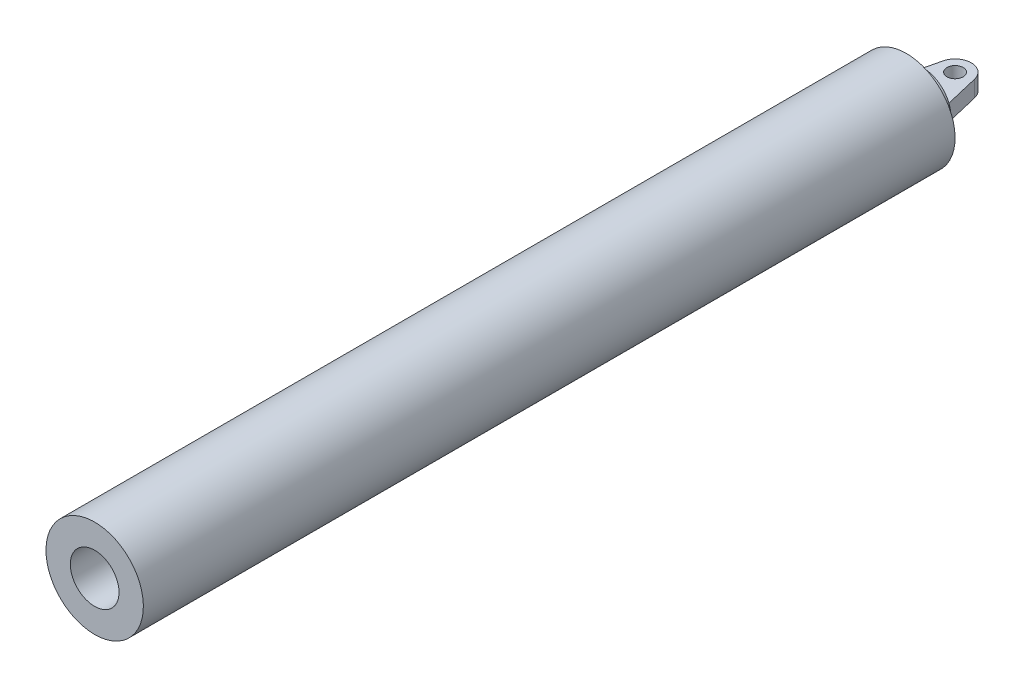
ISO-10303-21;
HEADER;
FILE_DESCRIPTION(('STEP AP214'),'2;1');
FILE_NAME('part.step','',(''),(''),'','','');
FILE_SCHEMA(('AUTOMOTIVE_DESIGN { 1 0 10303 214 1 1 1 1 }'));
ENDSEC;
DATA;
#1=APPLICATION_CONTEXT('core data for automotive mechanical design processes');
#2=APPLICATION_PROTOCOL_DEFINITION('international standard','automotive_design',2000,#1);
#3=PRODUCT_CONTEXT('',#1,'mechanical');
#4=PRODUCT('Part','Part','',(#3));
#5=PRODUCT_RELATED_PRODUCT_CATEGORY('part','',(#4));
#6=PRODUCT_DEFINITION_FORMATION('','',#4);
#7=PRODUCT_DEFINITION_CONTEXT('part definition',#1,'design');
#8=PRODUCT_DEFINITION('design','',#6,#7);
#9=PRODUCT_DEFINITION_SHAPE('','',#8);
#10=(LENGTH_UNIT() NAMED_UNIT(*) SI_UNIT(.MILLI.,.METRE.));
#11=(NAMED_UNIT(*) PLANE_ANGLE_UNIT() SI_UNIT($,.RADIAN.));
#12=(NAMED_UNIT(*) SI_UNIT($,.STERADIAN.) SOLID_ANGLE_UNIT());
#13=UNCERTAINTY_MEASURE_WITH_UNIT(LENGTH_MEASURE(1.E-05),#10,'distance_accuracy_value','');
#14=(GEOMETRIC_REPRESENTATION_CONTEXT(3) GLOBAL_UNCERTAINTY_ASSIGNED_CONTEXT((#13)) GLOBAL_UNIT_ASSIGNED_CONTEXT((#10,
#11,#12)) REPRESENTATION_CONTEXT('',''));
#15=CARTESIAN_POINT('',(0.,0.,0.));
#16=DIRECTION('',(0.,0.,1.));
#17=DIRECTION('',(1.,0.,0.));
#18=AXIS2_PLACEMENT_3D('',#15,#16,#17);
#19=CARTESIAN_POINT('',(0.,0.,500.));
#20=DIRECTION('',(0.,0.,1.));
#21=DIRECTION('',(0.924559245846981,0.381038319488817,0.));
#22=AXIS2_PLACEMENT_3D('',#19,#20,#21);
#23=PLANE('',#22);
#24=CARTESIAN_POINT('',(0.,0.,500.));
#25=DIRECTION('',(0.,0.,1.));
#26=DIRECTION('',(0.924559245846981,0.381038319488817,0.));
#27=AXIS2_PLACEMENT_3D('',#24,#25,#26);
#28=CIRCLE('',#27,30.);
#29=CARTESIAN_POINT('',(27.7367773754095,11.4311495846645,500.));
#30=VERTEX_POINT('',#29);
#31=EDGE_CURVE('P0_E10',#30,#30,#28,.T.);
#32=ORIENTED_EDGE('',*,*,#31,.T.);
#33=EDGE_LOOP('',(#32));
#34=FACE_BOUND('',#33,.T.);
#35=CARTESIAN_POINT('',(0.,0.,500.));
#36=DIRECTION('',(0.,0.,1.));
#37=DIRECTION('',(0.924559245846981,0.381038319488817,0.));
#38=AXIS2_PLACEMENT_3D('',#35,#36,#37);
#39=CIRCLE('',#38,15.);
#40=CARTESIAN_POINT('',(13.8683886877048,5.71557479233225,500.));
#41=VERTEX_POINT('',#40);
#42=EDGE_CURVE('P0_E26',#41,#41,#39,.T.);
#43=ORIENTED_EDGE('',*,*,#42,.F.);
#44=EDGE_LOOP('',(#43));
#45=FACE_BOUND('',#44,.T.);
#46=ADVANCED_FACE('P0_F15',(#34,#45),#23,.T.);
#47=CARTESIAN_POINT('',(0.,0.,0.));
#48=DIRECTION('',(0.,0.,1.));
#49=DIRECTION('',(0.924559245846981,0.381038319488817,0.));
#50=AXIS2_PLACEMENT_3D('',#47,#48,#49);
#51=PLANE('',#50);
#52=CARTESIAN_POINT('',(0.,0.,0.));
#53=DIRECTION('',(0.,0.,1.));
#54=DIRECTION('',(0.924559245846981,0.381038319488817,0.));
#55=AXIS2_PLACEMENT_3D('',#52,#53,#54);
#56=CIRCLE('',#55,30.);
#57=CARTESIAN_POINT('',(27.7367773754095,11.4311495846645,0.));
#58=VERTEX_POINT('',#57);
#59=EDGE_CURVE('P0_E19',#58,#58,#56,.T.);
#60=ORIENTED_EDGE('',*,*,#59,.F.);
#61=EDGE_LOOP('',(#60));
#62=FACE_BOUND('',#61,.T.);
#63=CARTESIAN_POINT('',(0.,0.,0.));
#64=DIRECTION('',(0.,0.,1.));
#65=DIRECTION('',(0.924559245846981,0.381038319488817,0.));
#66=AXIS2_PLACEMENT_3D('',#63,#64,#65);
#67=CIRCLE('',#66,15.);
#68=CARTESIAN_POINT('',(13.8683886877048,5.71557479233225,0.));
#69=VERTEX_POINT('',#68);
#70=EDGE_CURVE('P0_E28',#69,#69,#67,.T.);
#71=ORIENTED_EDGE('',*,*,#70,.T.);
#72=EDGE_LOOP('',(#71));
#73=FACE_BOUND('',#72,.T.);
#74=ADVANCED_FACE('P0_F38',(#62,#73),#51,.F.);
#75=CARTESIAN_POINT('',(0.,0.,500.));
#76=DIRECTION('',(0.,0.,-1.));
#77=DIRECTION('',(-0.924559245846981,-0.381038319488817,0.));
#78=AXIS2_PLACEMENT_3D('',#75,#76,#77);
#79=CYLINDRICAL_SURFACE('',#78,30.);
#80=ORIENTED_EDGE('',*,*,#31,.F.);
#81=EDGE_LOOP('',(#80));
#82=FACE_BOUND('',#81,.T.);
#83=ORIENTED_EDGE('',*,*,#59,.T.);
#84=EDGE_LOOP('',(#83));
#85=FACE_BOUND('',#84,.T.);
#86=ADVANCED_FACE('P0_F17',(#82,#85),#79,.T.);
#87=CARTESIAN_POINT('',(0.,0.,500.));
#88=DIRECTION('',(0.,0.,-1.));
#89=DIRECTION('',(-0.924559245846981,-0.381038319488817,0.));
#90=AXIS2_PLACEMENT_3D('',#87,#88,#89);
#91=CYLINDRICAL_SURFACE('',#90,15.);
#92=ORIENTED_EDGE('',*,*,#42,.T.);
#93=EDGE_LOOP('',(#92));
#94=FACE_BOUND('',#93,.T.);
#95=ORIENTED_EDGE('',*,*,#70,.F.);
#96=EDGE_LOOP('',(#95));
#97=FACE_BOUND('',#96,.T.);
#98=ADVANCED_FACE('P0_F34',(#94,#97),#91,.F.);
#99=CLOSED_SHELL('',(#46,#74,#86,#98));
#100=MANIFOLD_SOLID_BREP('P0_B1',#99);
#101=CARTESIAN_POINT('',(-4.46260575810839,5.,275.164077124258));
#102=DIRECTION('',(0.,1.,0.));
#103=DIRECTION('',(1.,0.,0.));
#104=AXIS2_PLACEMENT_3D('',#101,#102,#103);
#105=PLANE('',#104);
#106=CARTESIAN_POINT('',(0.,5.,-30.));
#107=DIRECTION('',(0.,1.,0.));
#108=DIRECTION('',(1.,0.,0.));
#109=AXIS2_PLACEMENT_3D('',#106,#107,#108);
#110=CIRCLE('',#109,5.00000000000001);
#111=CARTESIAN_POINT('',(5.00000000000004,5.,-30.));
#112=VERTEX_POINT('',#111);
#113=EDGE_CURVE('P1_E65',#112,#112,#110,.T.);
#114=ORIENTED_EDGE('',*,*,#113,.F.);
#115=EDGE_LOOP('',(#114));
#116=FACE_BOUND('',#115,.T.);
#117=DIRECTION('',(0.2299090833947,0.,-0.973212111192935));
#118=VECTOR('',#117,1.);
#119=CARTESIAN_POINT('',(-78.2485615185005,5.,257.733075946643));
#120=LINE('',#119,#118);
#121=CARTESIAN_POINT('',(-14.9999999999999,5.,-10.0000000000001));
#122=VERTEX_POINT('',#121);
#123=CARTESIAN_POINT('',(-9.73212111192933,5.,-32.299090833947));
#124=VERTEX_POINT('',#123);
#125=EDGE_CURVE('P1_E91',#122,#124,#120,.T.);
#126=ORIENTED_EDGE('',*,*,#125,.F.);
#127=DIRECTION('',(1.,0.,0.));
#128=VECTOR('',#127,1.);
#129=CARTESIAN_POINT('',(-4.46260575810839,5.,-10.));
#130=LINE('',#129,#128);
#131=CARTESIAN_POINT('',(15.,5.,-10.));
#132=VERTEX_POINT('',#131);
#133=EDGE_CURVE('P1_E79',#122,#132,#130,.T.);
#134=ORIENTED_EDGE('',*,*,#133,.T.);
#135=DIRECTION('',(-0.2299090833947,0.,-0.973212111192935));
#136=VECTOR('',#135,1.);
#137=CARTESIAN_POINT('',(77.7767910224875,5.,255.73605715276));
#138=LINE('',#137,#136);
#139=CARTESIAN_POINT('',(9.73212111192939,5.,-32.299090833947));
#140=VERTEX_POINT('',#139);
#141=EDGE_CURVE('P1_E33',#132,#140,#138,.T.);
#142=ORIENTED_EDGE('',*,*,#141,.T.);
#143=CARTESIAN_POINT('',(0.,5.,-30.));
#144=DIRECTION('',(0.,1.,0.));
#145=DIRECTION('',(1.,0.,0.));
#146=AXIS2_PLACEMENT_3D('',#143,#144,#145);
#147=CIRCLE('',#146,10.);
#148=EDGE_CURVE('P1_E57',#140,#124,#147,.T.);
#149=ORIENTED_EDGE('',*,*,#148,.T.);
#150=EDGE_LOOP('',(#126,#134,#142,#149));
#151=FACE_BOUND('',#150,.T.);
#152=ADVANCED_FACE('P1_F16',(#116,#151),#105,.T.);
#153=CARTESIAN_POINT('',(-4.46260575810839,-5.,275.164077124258));
#154=DIRECTION('',(0.,1.,0.));
#155=DIRECTION('',(1.,0.,0.));
#156=AXIS2_PLACEMENT_3D('',#153,#154,#155);
#157=PLANE('',#156);
#158=CARTESIAN_POINT('',(0.,-5.,-30.));
#159=DIRECTION('',(0.,1.,0.));
#160=DIRECTION('',(1.,0.,0.));
#161=AXIS2_PLACEMENT_3D('',#158,#159,#160);
#162=CIRCLE('',#161,5.00000000000001);
#163=CARTESIAN_POINT('',(5.00000000000004,-5.,-30.));
#164=VERTEX_POINT('',#163);
#165=EDGE_CURVE('P1_E87',#164,#164,#162,.T.);
#166=ORIENTED_EDGE('',*,*,#165,.T.);
#167=EDGE_LOOP('',(#166));
#168=FACE_BOUND('',#167,.T.);
#169=DIRECTION('',(1.,0.,0.));
#170=VECTOR('',#169,1.);
#171=CARTESIAN_POINT('',(-4.46260575810839,-5.,-10.));
#172=LINE('',#171,#170);
#173=CARTESIAN_POINT('',(-14.9999999999999,-5.,-10.0000000000001));
#174=VERTEX_POINT('',#173);
#175=CARTESIAN_POINT('',(15.,-5.,-10.));
#176=VERTEX_POINT('',#175);
#177=EDGE_CURVE('P1_E10',#174,#176,#172,.T.);
#178=ORIENTED_EDGE('',*,*,#177,.F.);
#179=DIRECTION('',(0.2299090833947,0.,-0.973212111192935));
#180=VECTOR('',#179,1.);
#181=CARTESIAN_POINT('',(-78.2485615185005,-5.,257.733075946643));
#182=LINE('',#181,#180);
#183=CARTESIAN_POINT('',(-9.73212111192933,-5.,-32.299090833947));
#184=VERTEX_POINT('',#183);
#185=EDGE_CURVE('P1_E66',#174,#184,#182,.T.);
#186=ORIENTED_EDGE('',*,*,#185,.T.);
#187=CARTESIAN_POINT('',(0.,-5.,-30.));
#188=DIRECTION('',(0.,1.,0.));
#189=DIRECTION('',(1.,0.,0.));
#190=AXIS2_PLACEMENT_3D('',#187,#188,#189);
#191=CIRCLE('',#190,10.);
#192=CARTESIAN_POINT('',(9.73212111192939,-5.,-32.299090833947));
#193=VERTEX_POINT('',#192);
#194=EDGE_CURVE('P1_E64',#193,#184,#191,.T.);
#195=ORIENTED_EDGE('',*,*,#194,.F.);
#196=DIRECTION('',(-0.2299090833947,0.,-0.973212111192935));
#197=VECTOR('',#196,1.);
#198=CARTESIAN_POINT('',(77.7767910224875,-5.,255.73605715276));
#199=LINE('',#198,#197);
#200=EDGE_CURVE('P1_E52',#176,#193,#199,.T.);
#201=ORIENTED_EDGE('',*,*,#200,.F.);
#202=EDGE_LOOP('',(#178,#186,#195,#201));
#203=FACE_BOUND('',#202,.T.);
#204=ADVANCED_FACE('P1_F62',(#168,#203),#157,.F.);
#205=CARTESIAN_POINT('',(0.,5.,-30.));
#206=DIRECTION('',(0.,-1.,0.));
#207=DIRECTION('',(-1.,0.,0.));
#208=AXIS2_PLACEMENT_3D('',#205,#206,#207);
#209=CYLINDRICAL_SURFACE('',#208,10.);
#210=ORIENTED_EDGE('',*,*,#194,.T.);
#211=DIRECTION('',(0.,-1.,0.));
#212=VECTOR('',#211,1.);
#213=CARTESIAN_POINT('',(-9.73212111192933,5.,-32.299090833947));
#214=LINE('',#213,#212);
#215=EDGE_CURVE('P1_E25',#124,#184,#214,.T.);
#216=ORIENTED_EDGE('',*,*,#215,.F.);
#217=ORIENTED_EDGE('',*,*,#148,.F.);
#218=DIRECTION('',(0.,-1.,0.));
#219=VECTOR('',#218,1.);
#220=CARTESIAN_POINT('',(9.73212111192939,5.,-32.299090833947));
#221=LINE('',#220,#219);
#222=EDGE_CURVE('P1_E74',#140,#193,#221,.T.);
#223=ORIENTED_EDGE('',*,*,#222,.T.);
#224=EDGE_LOOP('',(#210,#216,#217,#223));
#225=FACE_BOUND('',#224,.T.);
#226=ADVANCED_FACE('P1_F120',(#225),#209,.T.);
#227=CARTESIAN_POINT('',(-78.2485615185005,5.,257.733075946643));
#228=DIRECTION('',(-0.973212111192935,0.,-0.2299090833947));
#229=DIRECTION('',(-0.2299090833947,0.,0.973212111192935));
#230=AXIS2_PLACEMENT_3D('',#227,#228,#229);
#231=PLANE('',#230);
#232=ORIENTED_EDGE('',*,*,#185,.F.);
#233=DIRECTION('',(0.,-1.,0.));
#234=VECTOR('',#233,1.);
#235=CARTESIAN_POINT('',(-14.9999999999999,5.,-10.0000000000001));
#236=LINE('',#235,#234);
#237=EDGE_CURVE('P1_E73',#122,#174,#236,.T.);
#238=ORIENTED_EDGE('',*,*,#237,.F.);
#239=ORIENTED_EDGE('',*,*,#125,.T.);
#240=ORIENTED_EDGE('',*,*,#215,.T.);
#241=EDGE_LOOP('',(#232,#238,#239,#240));
#242=FACE_BOUND('',#241,.T.);
#243=ADVANCED_FACE('P1_F128',(#242),#231,.T.);
#244=CARTESIAN_POINT('',(0.,5.,-30.));
#245=DIRECTION('',(0.,-1.,0.));
#246=DIRECTION('',(-1.,0.,0.));
#247=AXIS2_PLACEMENT_3D('',#244,#245,#246);
#248=CYLINDRICAL_SURFACE('',#247,5.00000000000001);
#249=ORIENTED_EDGE('',*,*,#113,.T.);
#250=EDGE_LOOP('',(#249));
#251=FACE_BOUND('',#250,.T.);
#252=ORIENTED_EDGE('',*,*,#165,.F.);
#253=EDGE_LOOP('',(#252));
#254=FACE_BOUND('',#253,.T.);
#255=ADVANCED_FACE('P1_F18',(#251,#254),#248,.F.);
#256=CARTESIAN_POINT('',(77.7767910224875,5.,255.73605715276));
#257=DIRECTION('',(-0.973212111192935,0.,0.2299090833947));
#258=DIRECTION('',(0.2299090833947,0.,0.973212111192935));
#259=AXIS2_PLACEMENT_3D('',#256,#257,#258);
#260=PLANE('',#259);
#261=ORIENTED_EDGE('',*,*,#200,.T.);
#262=ORIENTED_EDGE('',*,*,#222,.F.);
#263=ORIENTED_EDGE('',*,*,#141,.F.);
#264=DIRECTION('',(0.,-1.,0.));
#265=VECTOR('',#264,1.);
#266=CARTESIAN_POINT('',(15.,5.,-10.));
#267=LINE('',#266,#265);
#268=EDGE_CURVE('P1_E69',#132,#176,#267,.T.);
#269=ORIENTED_EDGE('',*,*,#268,.T.);
#270=EDGE_LOOP('',(#261,#262,#263,#269));
#271=FACE_BOUND('',#270,.T.);
#272=ADVANCED_FACE('P1_F70',(#271),#260,.F.);
#273=CARTESIAN_POINT('',(0.,0.,0.));
#274=DIRECTION('',(0.,0.,-1.));
#275=DIRECTION('',(0.,1.,0.));
#276=AXIS2_PLACEMENT_3D('',#273,#274,#275);
#277=CYLINDRICAL_SURFACE('',#276,17.5);
#278=CARTESIAN_POINT('',(0.,0.,0.));
#279=DIRECTION('',(0.,0.,1.));
#280=DIRECTION('',(0.,-1.,0.));
#281=AXIS2_PLACEMENT_3D('',#278,#279,#280);
#282=CIRCLE('',#281,17.5);
#283=CARTESIAN_POINT('',(0.,-17.5,0.));
#284=VERTEX_POINT('',#283);
#285=EDGE_CURVE('P1_E97',#284,#284,#282,.T.);
#286=ORIENTED_EDGE('',*,*,#285,.F.);
#287=EDGE_LOOP('',(#286));
#288=FACE_BOUND('',#287,.T.);
#289=CARTESIAN_POINT('',(0.,0.,-10.));
#290=DIRECTION('',(0.,0.,1.));
#291=DIRECTION('',(0.,-1.,0.));
#292=AXIS2_PLACEMENT_3D('',#289,#290,#291);
#293=CIRCLE('',#292,17.5);
#294=CARTESIAN_POINT('',(0.,-17.5,-10.));
#295=VERTEX_POINT('',#294);
#296=EDGE_CURVE('P1_E100',#295,#295,#293,.T.);
#297=ORIENTED_EDGE('',*,*,#296,.T.);
#298=EDGE_LOOP('',(#297));
#299=FACE_BOUND('',#298,.T.);
#300=ADVANCED_FACE('P1_F104',(#288,#299),#277,.T.);
#301=CARTESIAN_POINT('',(0.,0.,0.));
#302=DIRECTION('',(0.,0.,1.));
#303=DIRECTION('',(0.,-1.,0.));
#304=AXIS2_PLACEMENT_3D('',#301,#302,#303);
#305=PLANE('',#304);
#306=ORIENTED_EDGE('',*,*,#285,.T.);
#307=EDGE_LOOP('',(#306));
#308=FACE_BOUND('',#307,.T.);
#309=ADVANCED_FACE('P1_F106',(#308),#305,.T.);
#310=CARTESIAN_POINT('',(0.,0.,-10.));
#311=DIRECTION('',(0.,0.,1.));
#312=DIRECTION('',(0.,-1.,0.));
#313=AXIS2_PLACEMENT_3D('',#310,#311,#312);
#314=PLANE('',#313);
#315=ORIENTED_EDGE('',*,*,#133,.F.);
#316=ORIENTED_EDGE('',*,*,#237,.T.);
#317=ORIENTED_EDGE('',*,*,#177,.T.);
#318=ORIENTED_EDGE('',*,*,#268,.F.);
#319=EDGE_LOOP('',(#315,#316,#317,#318));
#320=FACE_BOUND('',#319,.T.);
#321=ORIENTED_EDGE('',*,*,#296,.F.);
#322=EDGE_LOOP('',(#321));
#323=FACE_BOUND('',#322,.T.);
#324=ADVANCED_FACE('P1_F77',(#320,#323),#314,.F.);
#325=CLOSED_SHELL('',(#152,#204,#226,#243,#255,#272,#300,#309,#324));
#326=MANIFOLD_SOLID_BREP('P1_B1',#325);
#327=ADVANCED_BREP_SHAPE_REPRESENTATION('',(#18,#100,#326),#14);
#328=SHAPE_DEFINITION_REPRESENTATION(#9,#327);
ENDSEC;
END-ISO-10303-21;
